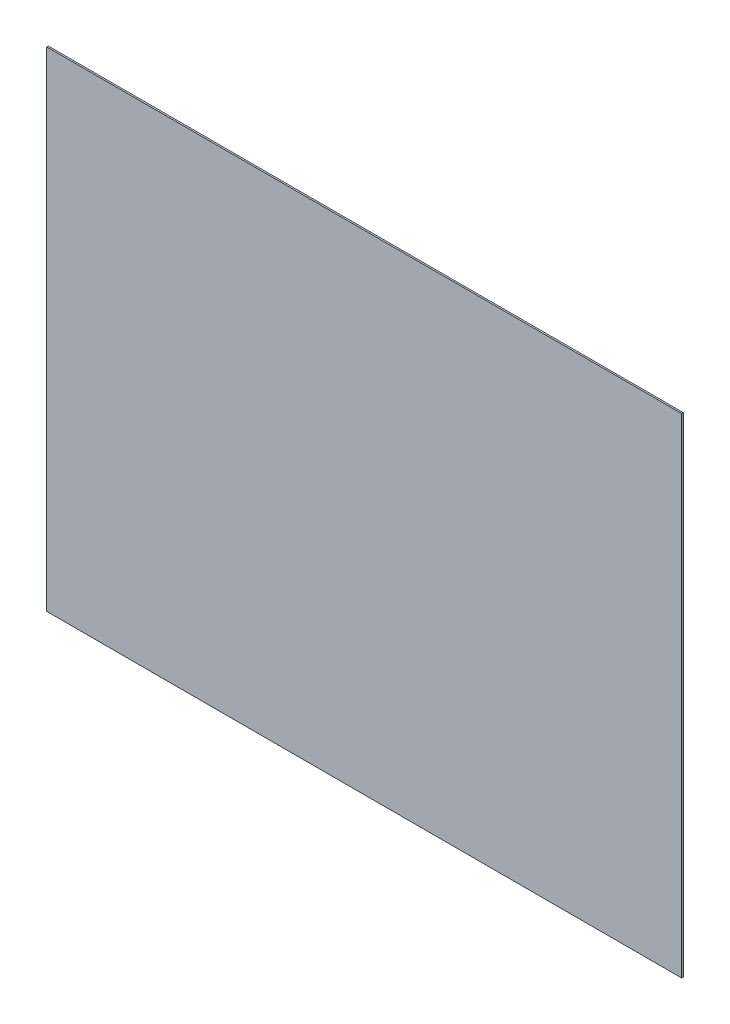
ISO-10303-21;
HEADER;
FILE_DESCRIPTION(('STEP AP214'),'2;1');
FILE_NAME('part.step','',(''),(''),'','','');
FILE_SCHEMA(('AUTOMOTIVE_DESIGN { 1 0 10303 214 1 1 1 1 }'));
ENDSEC;
DATA;
#1=APPLICATION_CONTEXT('core data for automotive mechanical design processes');
#2=APPLICATION_PROTOCOL_DEFINITION('international standard','automotive_design',2000,#1);
#3=PRODUCT_CONTEXT('',#1,'mechanical');
#4=PRODUCT('Part','Part','',(#3));
#5=PRODUCT_RELATED_PRODUCT_CATEGORY('part','',(#4));
#6=PRODUCT_DEFINITION_FORMATION('','',#4);
#7=PRODUCT_DEFINITION_CONTEXT('part definition',#1,'design');
#8=PRODUCT_DEFINITION('design','',#6,#7);
#9=PRODUCT_DEFINITION_SHAPE('','',#8);
#10=(LENGTH_UNIT() NAMED_UNIT(*) SI_UNIT(.MILLI.,.METRE.));
#11=(NAMED_UNIT(*) PLANE_ANGLE_UNIT() SI_UNIT($,.RADIAN.));
#12=(NAMED_UNIT(*) SI_UNIT($,.STERADIAN.) SOLID_ANGLE_UNIT());
#13=UNCERTAINTY_MEASURE_WITH_UNIT(LENGTH_MEASURE(1.E-05),#10,'distance_accuracy_value','');
#14=(GEOMETRIC_REPRESENTATION_CONTEXT(3) GLOBAL_UNCERTAINTY_ASSIGNED_CONTEXT((#13)) GLOBAL_UNIT_ASSIGNED_CONTEXT((#10,
#11,#12)) REPRESENTATION_CONTEXT('',''));
#15=CARTESIAN_POINT('',(0.,0.,0.));
#16=DIRECTION('',(0.,0.,1.));
#17=DIRECTION('',(1.,0.,0.));
#18=AXIS2_PLACEMENT_3D('',#15,#16,#17);
#19=CARTESIAN_POINT('',(0.,308.,1.));
#20=DIRECTION('',(1.,0.,0.));
#21=DIRECTION('',(0.,1.,0.));
#22=AXIS2_PLACEMENT_3D('',#19,#20,#21);
#23=PLANE('',#22);
#24=DIRECTION('',(0.,-1.,0.));
#25=VECTOR('',#24,1.);
#26=CARTESIAN_POINT('',(0.,308.,0.));
#27=LINE('',#26,#25);
#28=CARTESIAN_POINT('',(0.,308.,0.));
#29=VERTEX_POINT('',#28);
#30=CARTESIAN_POINT('',(0.,0.,0.));
#31=VERTEX_POINT('',#30);
#32=EDGE_CURVE('E86',#29,#31,#27,.T.);
#33=ORIENTED_EDGE('',*,*,#32,.T.);
#34=DIRECTION('',(0.,0.,-1.));
#35=VECTOR('',#34,1.);
#36=CARTESIAN_POINT('',(0.,0.,1.));
#37=LINE('',#36,#35);
#38=CARTESIAN_POINT('',(0.,0.,1.));
#39=VERTEX_POINT('',#38);
#40=EDGE_CURVE('E40',#39,#31,#37,.T.);
#41=ORIENTED_EDGE('',*,*,#40,.F.);
#42=DIRECTION('',(0.,-1.,0.));
#43=VECTOR('',#42,1.);
#44=CARTESIAN_POINT('',(0.,308.,1.));
#45=LINE('',#44,#43);
#46=CARTESIAN_POINT('',(0.,308.,1.));
#47=VERTEX_POINT('',#46);
#48=EDGE_CURVE('E78',#47,#39,#45,.T.);
#49=ORIENTED_EDGE('',*,*,#48,.F.);
#50=DIRECTION('',(0.,0.,-1.));
#51=VECTOR('',#50,1.);
#52=CARTESIAN_POINT('',(0.,308.,1.));
#53=LINE('',#52,#51);
#54=EDGE_CURVE('E11',#47,#29,#53,.T.);
#55=ORIENTED_EDGE('',*,*,#54,.T.);
#56=EDGE_LOOP('',(#33,#41,#49,#55));
#57=FACE_BOUND('',#56,.T.);
#58=ADVANCED_FACE('F32',(#57),#23,.F.);
#59=CARTESIAN_POINT('',(0.,0.,1.));
#60=DIRECTION('',(0.,1.,0.));
#61=DIRECTION('',(0.,0.,1.));
#62=AXIS2_PLACEMENT_3D('',#59,#60,#61);
#63=PLANE('',#62);
#64=DIRECTION('',(1.,0.,0.));
#65=VECTOR('',#64,1.);
#66=CARTESIAN_POINT('',(0.,0.,0.));
#67=LINE('',#66,#65);
#68=CARTESIAN_POINT('',(400.,0.,0.));
#69=VERTEX_POINT('',#68);
#70=EDGE_CURVE('E66',#31,#69,#67,.T.);
#71=ORIENTED_EDGE('',*,*,#70,.T.);
#72=DIRECTION('',(0.,0.,-1.));
#73=VECTOR('',#72,1.);
#74=CARTESIAN_POINT('',(400.,0.,1.));
#75=LINE('',#74,#73);
#76=CARTESIAN_POINT('',(400.,0.,1.));
#77=VERTEX_POINT('',#76);
#78=EDGE_CURVE('E87',#77,#69,#75,.T.);
#79=ORIENTED_EDGE('',*,*,#78,.F.);
#80=DIRECTION('',(1.,0.,0.));
#81=VECTOR('',#80,1.);
#82=CARTESIAN_POINT('',(0.,0.,1.));
#83=LINE('',#82,#81);
#84=EDGE_CURVE('E82',#39,#77,#83,.T.);
#85=ORIENTED_EDGE('',*,*,#84,.F.);
#86=ORIENTED_EDGE('',*,*,#40,.T.);
#87=EDGE_LOOP('',(#71,#79,#85,#86));
#88=FACE_BOUND('',#87,.T.);
#89=ADVANCED_FACE('F88',(#88),#63,.F.);
#90=CARTESIAN_POINT('',(400.,0.,1.));
#91=DIRECTION('',(-1.,0.,0.));
#92=DIRECTION('',(0.,0.,1.));
#93=AXIS2_PLACEMENT_3D('',#90,#91,#92);
#94=PLANE('',#93);
#95=DIRECTION('',(0.,1.,0.));
#96=VECTOR('',#95,1.);
#97=CARTESIAN_POINT('',(400.,0.,0.));
#98=LINE('',#97,#96);
#99=CARTESIAN_POINT('',(400.,308.,0.));
#100=VERTEX_POINT('',#99);
#101=EDGE_CURVE('E73',#69,#100,#98,.T.);
#102=ORIENTED_EDGE('',*,*,#101,.T.);
#103=DIRECTION('',(0.,0.,-1.));
#104=VECTOR('',#103,1.);
#105=CARTESIAN_POINT('',(400.,308.,1.));
#106=LINE('',#105,#104);
#107=CARTESIAN_POINT('',(400.,308.,1.));
#108=VERTEX_POINT('',#107);
#109=EDGE_CURVE('E92',#108,#100,#106,.T.);
#110=ORIENTED_EDGE('',*,*,#109,.F.);
#111=DIRECTION('',(0.,1.,0.));
#112=VECTOR('',#111,1.);
#113=CARTESIAN_POINT('',(400.,0.,1.));
#114=LINE('',#113,#112);
#115=EDGE_CURVE('E90',#77,#108,#114,.T.);
#116=ORIENTED_EDGE('',*,*,#115,.F.);
#117=ORIENTED_EDGE('',*,*,#78,.T.);
#118=EDGE_LOOP('',(#102,#110,#116,#117));
#119=FACE_BOUND('',#118,.T.);
#120=ADVANCED_FACE('F102',(#119),#94,.F.);
#121=CARTESIAN_POINT('',(400.,308.,1.));
#122=DIRECTION('',(0.,-1.,0.));
#123=DIRECTION('',(0.,0.,-1.));
#124=AXIS2_PLACEMENT_3D('',#121,#122,#123);
#125=PLANE('',#124);
#126=DIRECTION('',(-1.,0.,0.));
#127=VECTOR('',#126,1.);
#128=CARTESIAN_POINT('',(400.,308.,0.));
#129=LINE('',#128,#127);
#130=EDGE_CURVE('E99',#100,#29,#129,.T.);
#131=ORIENTED_EDGE('',*,*,#130,.T.);
#132=ORIENTED_EDGE('',*,*,#54,.F.);
#133=DIRECTION('',(-1.,0.,0.));
#134=VECTOR('',#133,1.);
#135=CARTESIAN_POINT('',(330.,308.,1.));
#136=LINE('',#135,#134);
#137=EDGE_CURVE('E48',#108,#47,#136,.T.);
#138=ORIENTED_EDGE('',*,*,#137,.F.);
#139=ORIENTED_EDGE('',*,*,#109,.T.);
#140=EDGE_LOOP('',(#131,#132,#138,#139));
#141=FACE_BOUND('',#140,.T.);
#142=ADVANCED_FACE('F106',(#141),#125,.F.);
#143=CARTESIAN_POINT('',(0.,0.,1.));
#144=DIRECTION('',(0.,0.,1.));
#145=DIRECTION('',(1.,0.,0.));
#146=AXIS2_PLACEMENT_3D('',#143,#144,#145);
#147=PLANE('',#146);
#148=ORIENTED_EDGE('',*,*,#137,.T.);
#149=ORIENTED_EDGE('',*,*,#48,.T.);
#150=ORIENTED_EDGE('',*,*,#84,.T.);
#151=ORIENTED_EDGE('',*,*,#115,.T.);
#152=EDGE_LOOP('',(#148,#149,#150,#151));
#153=FACE_BOUND('',#152,.T.);
#154=ADVANCED_FACE('F80',(#153),#147,.T.);
#155=CARTESIAN_POINT('',(0.,0.,0.));
#156=DIRECTION('',(0.,0.,1.));
#157=DIRECTION('',(1.,0.,0.));
#158=AXIS2_PLACEMENT_3D('',#155,#156,#157);
#159=PLANE('',#158);
#160=ORIENTED_EDGE('',*,*,#32,.F.);
#161=ORIENTED_EDGE('',*,*,#130,.F.);
#162=ORIENTED_EDGE('',*,*,#101,.F.);
#163=ORIENTED_EDGE('',*,*,#70,.F.);
#164=EDGE_LOOP('',(#160,#161,#162,#163));
#165=FACE_BOUND('',#164,.T.);
#166=ADVANCED_FACE('F105',(#165),#159,.F.);
#167=CLOSED_SHELL('',(#58,#89,#120,#142,#154,#166));
#168=MANIFOLD_SOLID_BREP('B2',#167);
#169=ADVANCED_BREP_SHAPE_REPRESENTATION('',(#18,#168),#14);
#170=SHAPE_DEFINITION_REPRESENTATION(#9,#169);
ENDSEC;
END-ISO-10303-21;
